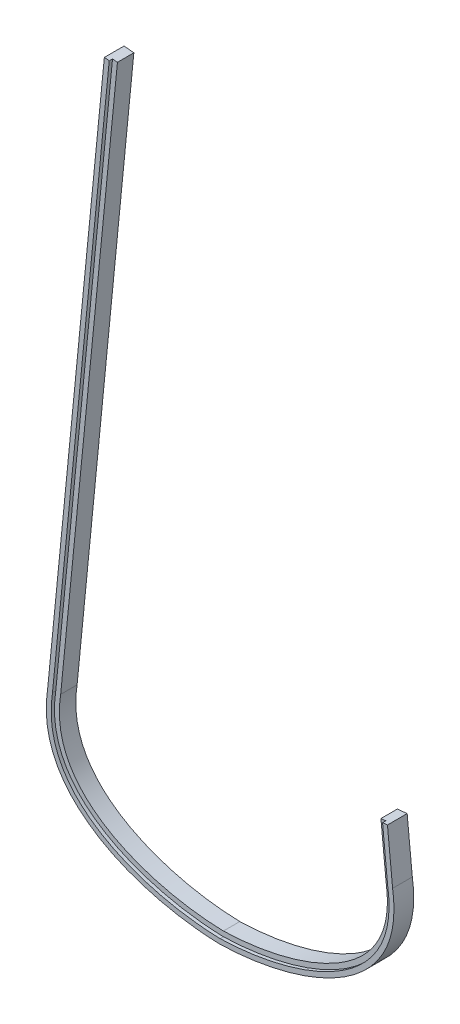
ISO-10303-21;
HEADER;
FILE_DESCRIPTION(('STEP AP214'),'2;1');
FILE_NAME('part.step','',(''),(''),'','','');
FILE_SCHEMA(('AUTOMOTIVE_DESIGN { 1 0 10303 214 1 1 1 1 }'));
ENDSEC;
DATA;
#1=APPLICATION_CONTEXT('core data for automotive mechanical design processes');
#2=APPLICATION_PROTOCOL_DEFINITION('international standard','automotive_design',2000,#1);
#3=PRODUCT_CONTEXT('',#1,'mechanical');
#4=PRODUCT('Part','Part','',(#3));
#5=PRODUCT_RELATED_PRODUCT_CATEGORY('part','',(#4));
#6=PRODUCT_DEFINITION_FORMATION('','',#4);
#7=PRODUCT_DEFINITION_CONTEXT('part definition',#1,'design');
#8=PRODUCT_DEFINITION('design','',#6,#7);
#9=PRODUCT_DEFINITION_SHAPE('','',#8);
#10=(LENGTH_UNIT() NAMED_UNIT(*) SI_UNIT(.MILLI.,.METRE.));
#11=(NAMED_UNIT(*) PLANE_ANGLE_UNIT() SI_UNIT($,.RADIAN.));
#12=(NAMED_UNIT(*) SI_UNIT($,.STERADIAN.) SOLID_ANGLE_UNIT());
#13=UNCERTAINTY_MEASURE_WITH_UNIT(LENGTH_MEASURE(1.E-05),#10,'distance_accuracy_value','');
#14=(GEOMETRIC_REPRESENTATION_CONTEXT(3) GLOBAL_UNCERTAINTY_ASSIGNED_CONTEXT((#13)) GLOBAL_UNIT_ASSIGNED_CONTEXT((#10,
#11,#12)) REPRESENTATION_CONTEXT('',''));
#15=CARTESIAN_POINT('',(0.,0.,0.));
#16=DIRECTION('',(0.,0.,1.));
#17=DIRECTION('',(1.,0.,0.));
#18=AXIS2_PLACEMENT_3D('',#15,#16,#17);
#19=CARTESIAN_POINT('',(152.2241731931,179.795336583671,19.05));
#20=DIRECTION('',(0.0981158450861748,-0.995175000159784,0.));
#21=DIRECTION('',(0.995175000159784,0.0981158450861748,0.));
#22=AXIS2_PLACEMENT_3D('',#19,#20,#21);
#23=PLANE('',#22);
#24=DIRECTION('',(0.,0.,-1.));
#25=VECTOR('',#24,1.);
#26=CARTESIAN_POINT('',(156.976332853863,180.263859367127,1004.92320168636));
#27=LINE('',#26,#25);
#28=CARTESIAN_POINT('',(156.976332853863,180.263859367127,19.05));
#29=VERTEX_POINT('',#28);
#30=CARTESIAN_POINT('',(156.976332853863,180.263859367127,15.875));
#31=VERTEX_POINT('',#30);
#32=EDGE_CURVE('E154',#29,#31,#27,.T.);
#33=ORIENTED_EDGE('',*,*,#32,.F.);
#34=DIRECTION('',(-0.995175000159784,-0.0981158450861748,0.));
#35=VECTOR('',#34,1.);
#36=CARTESIAN_POINT('',(152.2241731931,179.795336583671,19.05));
#37=LINE('',#36,#35);
#38=CARTESIAN_POINT('',(161.703215069622,180.729890008117,19.05));
#39=VERTEX_POINT('',#38);
#40=EDGE_CURVE('E142',#39,#29,#37,.T.);
#41=ORIENTED_EDGE('',*,*,#40,.F.);
#42=DIRECTION('',(0.,0.,-1.));
#43=VECTOR('',#42,1.);
#44=CARTESIAN_POINT('',(161.703215069622,180.729890008117,19.05));
#45=LINE('',#44,#43);
#46=CARTESIAN_POINT('',(161.703215069622,180.729890008117,0.));
#47=VERTEX_POINT('',#46);
#48=EDGE_CURVE('E42',#39,#47,#45,.T.);
#49=ORIENTED_EDGE('',*,*,#48,.T.);
#50=DIRECTION('',(-0.995175000159784,-0.0981158450861748,0.));
#51=VECTOR('',#50,1.);
#52=CARTESIAN_POINT('',(152.2241731931,179.795336583671,0.));
#53=LINE('',#52,#51);
#54=CARTESIAN_POINT('',(152.2241731931,179.795336583671,0.));
#55=VERTEX_POINT('',#54);
#56=EDGE_CURVE('E242',#47,#55,#53,.T.);
#57=ORIENTED_EDGE('',*,*,#56,.T.);
#58=DIRECTION('',(0.,0.,-1.));
#59=VECTOR('',#58,1.);
#60=CARTESIAN_POINT('',(152.2241731931,179.795336583671,19.05));
#61=LINE('',#60,#59);
#62=CARTESIAN_POINT('',(152.2241731931,179.795336583671,15.875));
#63=VERTEX_POINT('',#62);
#64=EDGE_CURVE('E295',#63,#55,#61,.T.);
#65=ORIENTED_EDGE('',*,*,#64,.F.);
#66=DIRECTION('',(-0.995175000159784,-0.0981158450861748,0.));
#67=VECTOR('',#66,1.);
#68=CARTESIAN_POINT('',(152.2241731931,179.795336583671,15.875));
#69=LINE('',#68,#67);
#70=EDGE_CURVE('E49',#31,#63,#69,.T.);
#71=ORIENTED_EDGE('',*,*,#70,.F.);
#72=EDGE_LOOP('',(#33,#41,#49,#57,#65,#71));
#73=FACE_BOUND('',#72,.T.);
#74=ADVANCED_FACE('F33',(#73),#23,.F.);
#75=CARTESIAN_POINT('',(-111.860365765845,686.278790089287,19.05));
#76=DIRECTION('',(-0.0981158450861748,-0.995175000159784,0.));
#77=DIRECTION('',(0.995175000159784,-0.0981158450861748,0.));
#78=AXIS2_PLACEMENT_3D('',#75,#76,#77);
#79=PLANE('',#78);
#80=DIRECTION('',(0.,0.,-1.));
#81=VECTOR('',#80,1.);
#82=CARTESIAN_POINT('',(-107.133483550086,685.812759448297,1004.92320168636));
#83=LINE('',#82,#81);
#84=CARTESIAN_POINT('',(-107.133483550086,685.812759448297,19.05));
#85=VERTEX_POINT('',#84);
#86=CARTESIAN_POINT('',(-107.133483550088,685.812759448297,15.875));
#87=VERTEX_POINT('',#86);
#88=EDGE_CURVE('E174',#85,#87,#83,.T.);
#89=ORIENTED_EDGE('',*,*,#88,.T.);
#90=DIRECTION('',(-0.995175000159784,0.0981158450861748,0.));
#91=VECTOR('',#90,1.);
#92=CARTESIAN_POINT('',(-111.860365765845,686.278790089287,15.875));
#93=LINE('',#92,#91);
#94=CARTESIAN_POINT('',(-102.381323889323,685.344236664841,15.875));
#95=VERTEX_POINT('',#94);
#96=EDGE_CURVE('E328',#95,#87,#93,.T.);
#97=ORIENTED_EDGE('',*,*,#96,.F.);
#98=DIRECTION('',(0.,0.,-1.));
#99=VECTOR('',#98,1.);
#100=CARTESIAN_POINT('',(-102.381323889323,685.344236664841,19.05));
#101=LINE('',#100,#99);
#102=CARTESIAN_POINT('',(-102.381323889323,685.344236664841,0.));
#103=VERTEX_POINT('',#102);
#104=EDGE_CURVE('E287',#95,#103,#101,.T.);
#105=ORIENTED_EDGE('',*,*,#104,.T.);
#106=DIRECTION('',(-0.995175000159784,0.0981158450861748,0.));
#107=VECTOR('',#106,1.);
#108=CARTESIAN_POINT('',(-111.860365765845,686.278790089287,0.));
#109=LINE('',#108,#107);
#110=CARTESIAN_POINT('',(-111.860365765845,686.278790089287,0.));
#111=VERTEX_POINT('',#110);
#112=EDGE_CURVE('E267',#103,#111,#109,.T.);
#113=ORIENTED_EDGE('',*,*,#112,.T.);
#114=DIRECTION('',(0.,0.,-1.));
#115=VECTOR('',#114,1.);
#116=CARTESIAN_POINT('',(-111.860365765845,686.278790089287,19.05));
#117=LINE('',#116,#115);
#118=CARTESIAN_POINT('',(-111.860365765845,686.278790089287,19.05));
#119=VERTEX_POINT('',#118);
#120=EDGE_CURVE('E284',#119,#111,#117,.T.);
#121=ORIENTED_EDGE('',*,*,#120,.F.);
#122=DIRECTION('',(-0.995175000159784,0.0981158450861748,0.));
#123=VECTOR('',#122,1.);
#124=CARTESIAN_POINT('',(-111.860365765845,686.278790089287,19.05));
#125=LINE('',#124,#123);
#126=EDGE_CURVE('E151',#85,#119,#125,.T.);
#127=ORIENTED_EDGE('',*,*,#126,.F.);
#128=EDGE_LOOP('',(#89,#97,#105,#113,#121,#127));
#129=FACE_BOUND('',#128,.T.);
#130=ADVANCED_FACE('F210',(#129),#79,.F.);
#131=CARTESIAN_POINT('',(116.406439868411,30.4999418503284,19.05));
#132=DIRECTION('',(0.,0.,-1.));
#133=DIRECTION('',(-1.,0.,0.));
#134=AXIS2_PLACEMENT_3D('',#131,#132,#133);
#135=PLANE('',#134);
#136=DIRECTION('',(0.0981158450861758,0.995175000159784,0.));
#137=VECTOR('',#136,1.);
#138=CARTESIAN_POINT('',(-107.133483550086,685.812759448297,19.05));
#139=LINE('',#138,#137);
#140=CARTESIAN_POINT('',(-161.973395498476,129.579366828916,19.05));
#141=VERTEX_POINT('',#140);
#142=EDGE_CURVE('E330',#141,#85,#139,.T.);
#143=ORIENTED_EDGE('',*,*,#142,.T.);
#144=ORIENTED_EDGE('',*,*,#126,.T.);
#145=DIRECTION('',(-0.0981158450861758,-0.995175000159784,0.));
#146=VECTOR('',#145,1.);
#147=CARTESIAN_POINT('',(-166.6875,130.175,19.05));
#148=LINE('',#147,#146);
#149=CARTESIAN_POINT('',(-166.6875,130.175,19.05));
#150=VERTEX_POINT('',#149);
#151=EDGE_CURVE('E228',#119,#150,#148,.T.);
#152=ORIENTED_EDGE('',*,*,#151,.T.);
#153=CARTESIAN_POINT('',(-166.6875,130.175,19.05));
#154=CARTESIAN_POINT('',(-181.188092360691,36.2008356091117,19.05));
#155=CARTESIAN_POINT('',(-73.6665806217367,1.74067599176395,19.05));
#156=CARTESIAN_POINT('',(0.,0.,19.05));
#157=B_SPLINE_CURVE_WITH_KNOTS('',3,(#153,#154,#155,#156),.UNSPECIFIED.,.F.,.F.,(4,4),(0.,1.),.UNSPECIFIED.);
#158=CARTESIAN_POINT('',(0.,0.,19.05));
#159=VERTEX_POINT('',#158);
#160=EDGE_CURVE('E221',#150,#159,#157,.T.);
#161=ORIENTED_EDGE('',*,*,#160,.T.);
#162=CARTESIAN_POINT('',(0.,0.,19.05));
#163=CARTESIAN_POINT('',(73.6665806217367,1.74067599176395,19.05));
#164=CARTESIAN_POINT('',(181.188092360691,36.2008356091117,19.05));
#165=CARTESIAN_POINT('',(166.6875,130.175,19.05));
#166=B_SPLINE_CURVE_WITH_KNOTS('',3,(#162,#163,#164,#165),.UNSPECIFIED.,.F.,.F.,(4,4),(0.,1.),.UNSPECIFIED.);
#167=CARTESIAN_POINT('',(166.6875,130.175,19.05));
#168=VERTEX_POINT('',#167);
#169=EDGE_CURVE('E275',#159,#168,#166,.T.);
#170=ORIENTED_EDGE('',*,*,#169,.T.);
#171=DIRECTION('',(-0.0981158450861751,0.995175000159784,0.));
#172=VECTOR('',#171,1.);
#173=CARTESIAN_POINT('',(166.6875,130.175,19.05));
#174=LINE('',#173,#172);
#175=EDGE_CURVE('E148',#168,#39,#174,.T.);
#176=ORIENTED_EDGE('',*,*,#175,.T.);
#177=ORIENTED_EDGE('',*,*,#40,.T.);
#178=DIRECTION('',(0.0981158450861751,-0.995175000159784,0.));
#179=VECTOR('',#178,1.);
#180=CARTESIAN_POINT('',(161.973395498476,129.579366828916,19.05));
#181=LINE('',#180,#179);
#182=CARTESIAN_POINT('',(161.973395498476,129.579366828916,19.05));
#183=VERTEX_POINT('',#182);
#184=EDGE_CURVE('E145',#29,#183,#181,.T.);
#185=ORIENTED_EDGE('',*,*,#184,.T.);
#186=CARTESIAN_POINT('',(0.,4.75115094781175,19.05));
#187=CARTESIAN_POINT('',(9.04086704814806,4.96882985998488,19.05));
#188=CARTESIAN_POINT('',(18.6188377679575,5.68935997812849,19.05));
#189=CARTESIAN_POINT('',(38.2135660454949,8.24005886868246,19.05));
#190=CARTESIAN_POINT('',(48.2306301838691,10.0702165133301,19.05));
#191=CARTESIAN_POINT('',(68.0758906685515,14.9340860270054,19.05));
#192=CARTESIAN_POINT('',(77.9040582812842,17.9680134662575,19.05));
#193=CARTESIAN_POINT('',(96.7462292371681,25.3204715644106,19.05));
#194=CARTESIAN_POINT('',(105.759630554442,29.6392292408285,19.05));
#195=CARTESIAN_POINT('',(122.357367523378,39.621644840968,19.05));
#196=CARTESIAN_POINT('',(129.940113205013,45.2843535157301,19.05));
#197=CARTESIAN_POINT('',(139.81311424625,54.8199574214553,19.05));
#198=CARTESIAN_POINT('',(142.854480947945,58.1720089135256,19.05));
#199=CARTESIAN_POINT('',(148.374445898117,65.2328355384419,19.05));
#200=CARTESIAN_POINT('',(150.853165212881,68.9414654515358,19.05));
#201=CARTESIAN_POINT('',(155.188366145905,76.7330216576851,19.05));
#202=CARTESIAN_POINT('',(157.045094148206,80.8159513897656,19.05));
#203=CARTESIAN_POINT('',(160.075199692569,89.384607046216,19.05));
#204=CARTESIAN_POINT('',(161.248767489306,93.8705723700118,19.05));
#205=CARTESIAN_POINT('',(162.842404670833,103.281195989753,19.05));
#206=CARTESIAN_POINT('',(163.262423556054,108.206156668145,19.05));
#207=CARTESIAN_POINT('',(163.265984358027,115.948323614976,19.05));
#208=CARTESIAN_POINT('',(163.16267737973,118.588121623498,19.05));
#209=CARTESIAN_POINT('',(162.842770083122,122.639027203061,19.05));
#210=CARTESIAN_POINT('',(162.708640489147,124.004525813686,19.05));
#211=CARTESIAN_POINT('',(162.46516212669,126.075850352861,19.05));
#212=CARTESIAN_POINT('',(162.332851825039,127.117281326474,19.05));
#213=CARTESIAN_POINT('',(162.159761135535,128.342436218243,19.05));
#214=CARTESIAN_POINT('',(162.081541527909,128.86968384369,19.05));
#215=CARTESIAN_POINT('',(162.028495082377,129.221667617639,19.05));
#216=CARTESIAN_POINT('',(162.001715249747,129.395834674141,19.05));
#217=CARTESIAN_POINT('',(161.973395498476,129.579366828916,19.05));
#218=B_SPLINE_CURVE_WITH_KNOTS('',3,(#186,#187,#188,#189,#190,#191,#192,#193,#194,#195,#196,
#197,#198,#199,#200,#201,#202,#203,#204,#205,#206,#207,#208,#209,#210,#211,#212,#213,#214,#215,
#216,#217),.UNSPECIFIED.,.F.,.F.,(4,2,2,2,2,2,2,2,2,2,2,2,2,1,1,2,4),(0.,0.125,0.25,0.375,0.5,
0.625,0.6875,0.75,0.8125,0.875,0.9375,0.96875,0.984375,0.9921875,0.99609375,0.998046875,1.),.UNSPECIFIED.);
#219=CARTESIAN_POINT('',(0.,4.75115094781175,19.05));
#220=VERTEX_POINT('',#219);
#221=EDGE_CURVE('E164',#183,#220,#218,.F.);
#222=ORIENTED_EDGE('',*,*,#221,.T.);
#223=CARTESIAN_POINT('',(-161.973395498476,129.579366828916,19.05));
#224=CARTESIAN_POINT('',(-162.001715249747,129.39583467414,19.05));
#225=CARTESIAN_POINT('',(-162.028495082377,129.221667617639,19.05));
#226=CARTESIAN_POINT('',(-162.081541527909,128.869683843689,19.05));
#227=CARTESIAN_POINT('',(-162.159761135535,128.342436218243,19.05));
#228=CARTESIAN_POINT('',(-162.332851825039,127.117281326474,19.05));
#229=CARTESIAN_POINT('',(-162.641575692159,124.687275118998,19.05));
#230=CARTESIAN_POINT('',(-162.842770083122,122.639027203061,19.05));
#231=CARTESIAN_POINT('',(-163.16267737973,118.588121623498,19.05));
#232=CARTESIAN_POINT('',(-163.265984358027,115.948323614976,19.05));
#233=CARTESIAN_POINT('',(-163.262423556053,108.206156668145,19.05));
#234=CARTESIAN_POINT('',(-162.842404670833,103.281195989753,19.05));
#235=CARTESIAN_POINT('',(-161.248767489306,93.8705723700115,19.05));
#236=CARTESIAN_POINT('',(-160.075199692569,89.3846070462159,19.05));
#237=CARTESIAN_POINT('',(-157.045094148206,80.8159513897654,19.05));
#238=CARTESIAN_POINT('',(-155.188366145905,76.7330216576849,19.05));
#239=CARTESIAN_POINT('',(-150.853165212881,68.9414654515357,19.05));
#240=CARTESIAN_POINT('',(-148.374445898117,65.2328355384417,19.05));
#241=CARTESIAN_POINT('',(-142.854480947945,58.1720089135254,19.05));
#242=CARTESIAN_POINT('',(-139.81311424625,54.8199574214552,19.05));
#243=CARTESIAN_POINT('',(-129.940113205013,45.28435351573,19.05));
#244=CARTESIAN_POINT('',(-122.357367523378,39.621644840968,19.05));
#245=CARTESIAN_POINT('',(-105.759630554442,29.6392292408284,19.05));
#246=CARTESIAN_POINT('',(-96.7462292371681,25.3204715644106,19.05));
#247=CARTESIAN_POINT('',(-77.9040582812842,17.9680134662575,19.05));
#248=CARTESIAN_POINT('',(-68.0758906685514,14.9340860270054,19.05));
#249=CARTESIAN_POINT('',(-48.2306301838691,10.0702165133301,19.05));
#250=CARTESIAN_POINT('',(-38.2135660454949,8.24005886868246,19.05));
#251=CARTESIAN_POINT('',(-18.6188377679576,5.68935997812849,19.05));
#252=CARTESIAN_POINT('',(-9.04086704814806,4.96882985998489,19.05));
#253=CARTESIAN_POINT('',(0.,4.75115094781175,19.05));
#254=B_SPLINE_CURVE_WITH_KNOTS('',3,(#223,#224,#225,#226,#227,#228,#229,#230,#231,#232,#233,
#234,#235,#236,#237,#238,#239,#240,#241,#242,#243,#244,#245,#246,#247,#248,#249,#250,#251,#252,
#253),.UNSPECIFIED.,.F.,.F.,(4,2,1,1,1,2,2,2,2,2,2,2,2,2,2,2,4),(0.,0.00195312499999983,
0.00390624999999966,0.00781249999999967,0.0156249999999997,0.0312499999999997,
0.0624999999999996,0.124999999999999,0.187499999999999,0.249999999999999,0.312499999999999,
0.374999999999999,0.499999999999999,0.624999999999999,0.75,0.875,1.),.UNSPECIFIED.);
#255=EDGE_CURVE('E168',#220,#141,#254,.F.);
#256=ORIENTED_EDGE('',*,*,#255,.T.);
#257=EDGE_LOOP('',(#143,#144,#152,#161,#170,#176,#177,#185,#222,#256));
#258=FACE_BOUND('',#257,.T.);
#259=ADVANCED_FACE('F143',(#258),#135,.F.);
#260=DIRECTION('',(0.,0.,-1.));
#261=VECTOR('',#260,1.);
#262=SURFACE_OF_LINEAR_EXTRUSION('',#166,#261);
#263=CARTESIAN_POINT('',(0.,0.,0.));
#264=CARTESIAN_POINT('',(73.6665806217367,1.74067599176395,0.));
#265=CARTESIAN_POINT('',(181.188092360691,36.2008356091117,0.));
#266=CARTESIAN_POINT('',(166.6875,130.175,0.));
#267=B_SPLINE_CURVE_WITH_KNOTS('',3,(#263,#264,#265,#266),.UNSPECIFIED.,.F.,.F.,(4,4),(0.,1.),.UNSPECIFIED.);
#268=CARTESIAN_POINT('',(0.,0.,0.));
#269=VERTEX_POINT('',#268);
#270=CARTESIAN_POINT('',(166.6875,130.175,0.));
#271=VERTEX_POINT('',#270);
#272=EDGE_CURVE('E176',#269,#271,#267,.T.);
#273=ORIENTED_EDGE('',*,*,#272,.T.);
#274=DIRECTION('',(0.,0.,-1.));
#275=VECTOR('',#274,1.);
#276=CARTESIAN_POINT('',(166.6875,130.175,19.05));
#277=LINE('',#276,#275);
#278=EDGE_CURVE('E11',#168,#271,#277,.T.);
#279=ORIENTED_EDGE('',*,*,#278,.F.);
#280=ORIENTED_EDGE('',*,*,#169,.F.);
#281=DIRECTION('',(0.,0.,-1.));
#282=VECTOR('',#281,1.);
#283=CARTESIAN_POINT('',(0.,0.,19.05));
#284=LINE('',#283,#282);
#285=EDGE_CURVE('E227',#159,#269,#284,.T.);
#286=ORIENTED_EDGE('',*,*,#285,.T.);
#287=EDGE_LOOP('',(#273,#279,#280,#286));
#288=FACE_BOUND('',#287,.T.);
#289=ADVANCED_FACE('F35',(#288),#262,.F.);
#290=CARTESIAN_POINT('',(166.6875,130.175,19.05));
#291=DIRECTION('',(-0.995175000159784,-0.0981158450861751,0.));
#292=DIRECTION('',(0.0981158450861752,-0.995175000159784,0.));
#293=AXIS2_PLACEMENT_3D('',#290,#291,#292);
#294=PLANE('',#293);
#295=DIRECTION('',(-0.0981158450861751,0.995175000159784,0.));
#296=VECTOR('',#295,1.);
#297=CARTESIAN_POINT('',(166.6875,130.175,0.));
#298=LINE('',#297,#296);
#299=EDGE_CURVE('E237',#271,#47,#298,.T.);
#300=ORIENTED_EDGE('',*,*,#299,.T.);
#301=ORIENTED_EDGE('',*,*,#48,.F.);
#302=ORIENTED_EDGE('',*,*,#175,.F.);
#303=ORIENTED_EDGE('',*,*,#278,.T.);
#304=EDGE_LOOP('',(#300,#301,#302,#303));
#305=FACE_BOUND('',#304,.T.);
#306=ADVANCED_FACE('F359',(#305),#294,.F.);
#307=CARTESIAN_POINT('',(157.23408188197,128.980548453709,19.05));
#308=DIRECTION('',(0.995175000159784,0.0981158450861752,0.));
#309=DIRECTION('',(-0.0981158450861752,0.995175000159784,0.));
#310=AXIS2_PLACEMENT_3D('',#307,#308,#309);
#311=PLANE('',#310);
#312=DIRECTION('',(0.,0.,-1.));
#313=VECTOR('',#312,1.);
#314=CARTESIAN_POINT('',(157.23408188197,128.980548453709,19.05));
#315=LINE('',#314,#313);
#316=CARTESIAN_POINT('',(157.23408188197,128.980548453709,15.875));
#317=VERTEX_POINT('',#316);
#318=CARTESIAN_POINT('',(157.23408188197,128.980548453709,0.));
#319=VERTEX_POINT('',#318);
#320=EDGE_CURVE('E293',#317,#319,#315,.T.);
#321=ORIENTED_EDGE('',*,*,#320,.F.);
#322=DIRECTION('',(0.0981158450861752,-0.995175000159784,0.));
#323=VECTOR('',#322,1.);
#324=CARTESIAN_POINT('',(157.23408188197,128.980548453709,15.875));
#325=LINE('',#324,#323);
#326=EDGE_CURVE('E57',#63,#317,#325,.T.);
#327=ORIENTED_EDGE('',*,*,#326,.F.);
#328=ORIENTED_EDGE('',*,*,#64,.T.);
#329=DIRECTION('',(0.0981158450861752,-0.995175000159784,0.));
#330=VECTOR('',#329,1.);
#331=CARTESIAN_POINT('',(157.23408188197,128.980548453709,0.));
#332=LINE('',#331,#330);
#333=EDGE_CURVE('E245',#55,#319,#332,.T.);
#334=ORIENTED_EDGE('',*,*,#333,.T.);
#335=EDGE_LOOP('',(#321,#327,#328,#334));
#336=FACE_BOUND('',#335,.T.);
#337=ADVANCED_FACE('F302',(#336),#311,.F.);
#338=CARTESIAN_POINT('',(157.23408188197,128.980548453709,19.05));
#339=CARTESIAN_POINT('',(157.261207353425,128.80475608259,19.05));
#340=CARTESIAN_POINT('',(157.316566229368,128.44670539477,19.05));
#341=CARTESIAN_POINT('',(157.415798732615,127.781927865814,19.05));
#342=CARTESIAN_POINT('',(157.584058118054,126.601085874369,19.05));
#343=CARTESIAN_POINT('',(157.881730698016,124.277278240634,19.05));
#344=CARTESIAN_POINT('',(158.206421640057,121.010360534751,19.05));
#345=CARTESIAN_POINT('',(158.437150465931,117.190167218602,19.05));
#346=CARTESIAN_POINT('',(158.540175043748,112.221426054033,19.05));
#347=CARTESIAN_POINT('',(158.296409220294,106.242287004757,19.05));
#348=CARTESIAN_POINT('',(157.442658539271,99.4182067892226,19.05));
#349=CARTESIAN_POINT('',(156.058613173129,92.923629982478,19.05));
#350=CARTESIAN_POINT('',(153.541361304269,84.6740226733845,19.05));
#351=CARTESIAN_POINT('',(149.192253507085,75.0755375544253,19.05));
#352=CARTESIAN_POINT('',(142.189146148936,64.5645369341676,19.05));
#353=CARTESIAN_POINT('',(130.643933927823,51.8035577227428,19.05));
#354=CARTESIAN_POINT('',(112.436111513656,38.1574524872599,19.05));
#355=CARTESIAN_POINT('',(90.5158541949529,27.6265370641219,19.05));
#356=CARTESIAN_POINT('',(71.6896130592172,21.0508508509878,19.05));
#357=CARTESIAN_POINT('',(57.16523288768,17.0231489798574,19.05));
#358=CARTESIAN_POINT('',(42.4774975697848,13.8758580326201,19.05));
#359=CARTESIAN_POINT('',(30.3032357230849,11.9623162671414,19.05));
#360=CARTESIAN_POINT('',(20.7254590356733,10.8404413717739,19.05));
#361=CARTESIAN_POINT('',(13.6522104162235,10.1989584372761,19.05));
#362=CARTESIAN_POINT('',(7.88003948147285,9.82720773209708,19.05));
#363=CARTESIAN_POINT('',(3.34047289736703,9.62475505591648,19.05));
#364=CARTESIAN_POINT('',(1.11761160220118,9.55519319222505,19.05));
#365=CARTESIAN_POINT('',(0.,9.52776173986118,19.05));
#366=B_SPLINE_CURVE_WITH_KNOTS('',3,(#338,#339,#340,#341,#342,#343,#344,#345,#346,#347,#348,
#349,#350,#351,#352,#353,#354,#355,#356,#357,#358,#359,#360,#361,#362,#363,#364,#365),
.UNSPECIFIED.,.F.,.F.,(4,1,1,1,1,1,1,1,1,1,1,1,1,1,1,1,1,1,1,1,1,1,1,1,1,4),
(0.00105703595463424,0.00300988454184536,0.00496273312905637,0.0088684303034785,
0.0166798246523227,0.0323026133500111,0.0479254020476996,0.063548190745388,0.0947937681407649,
0.126039345536142,0.157284922931519,0.188530500326895,0.251021655117649,0.313512809908403,
0.376003964699156,0.500986274280664,0.625968583862171,0.688459738652925,0.750950893443679,
0.813442048234432,0.875933203025186,0.907178780420563,0.93842435781594,0.969669935211317,
0.985292723909005,1.00091551260669),.UNSPECIFIED.);
#367=DIRECTION('',(0.,0.,-1.));
#368=VECTOR('',#367,1.);
#369=SURFACE_OF_LINEAR_EXTRUSION('',#366,#368);
#370=DIRECTION('',(0.,0.,-1.));
#371=VECTOR('',#370,1.);
#372=CARTESIAN_POINT('',(0.,9.52776173986118,19.05));
#373=LINE('',#372,#371);
#374=CARTESIAN_POINT('',(0.,9.52776173986118,15.875));
#375=VERTEX_POINT('',#374);
#376=CARTESIAN_POINT('',(0.,9.52776173986118,0.));
#377=VERTEX_POINT('',#376);
#378=EDGE_CURVE('E291',#375,#377,#373,.T.);
#379=ORIENTED_EDGE('',*,*,#378,.F.);
#380=CARTESIAN_POINT('',(157.23408188197,128.980548453709,15.875));
#381=CARTESIAN_POINT('',(157.261207353425,128.80475608259,15.875));
#382=CARTESIAN_POINT('',(157.316566229368,128.44670539477,15.875));
#383=CARTESIAN_POINT('',(157.415798732615,127.781927865814,15.875));
#384=CARTESIAN_POINT('',(157.584058118054,126.601085874369,15.875));
#385=CARTESIAN_POINT('',(157.881730698016,124.277278240634,15.875));
#386=CARTESIAN_POINT('',(158.206421640057,121.010360534751,15.875));
#387=CARTESIAN_POINT('',(158.437150465931,117.190167218602,15.875));
#388=CARTESIAN_POINT('',(158.540175043748,112.221426054033,15.875));
#389=CARTESIAN_POINT('',(158.296409220294,106.242287004757,15.875));
#390=CARTESIAN_POINT('',(157.442658539271,99.4182067892226,15.875));
#391=CARTESIAN_POINT('',(156.058613173129,92.923629982478,15.875));
#392=CARTESIAN_POINT('',(153.541361304269,84.6740226733845,15.875));
#393=CARTESIAN_POINT('',(149.192253507085,75.0755375544253,15.875));
#394=CARTESIAN_POINT('',(142.189146148936,64.5645369341676,15.875));
#395=CARTESIAN_POINT('',(130.643933927823,51.8035577227428,15.875));
#396=CARTESIAN_POINT('',(112.436111513656,38.1574524872599,15.875));
#397=CARTESIAN_POINT('',(90.5158541949529,27.6265370641219,15.875));
#398=CARTESIAN_POINT('',(71.6896130592172,21.0508508509878,15.875));
#399=CARTESIAN_POINT('',(57.16523288768,17.0231489798574,15.875));
#400=CARTESIAN_POINT('',(42.4774975697848,13.8758580326201,15.875));
#401=CARTESIAN_POINT('',(30.3032357230849,11.9623162671414,15.875));
#402=CARTESIAN_POINT('',(20.7254590356733,10.8404413717739,15.875));
#403=CARTESIAN_POINT('',(13.6522104162235,10.1989584372761,15.875));
#404=CARTESIAN_POINT('',(7.88003948147285,9.82720773209708,15.875));
#405=CARTESIAN_POINT('',(3.34047289736703,9.62475505591648,15.875));
#406=CARTESIAN_POINT('',(1.11761160220118,9.55519319222505,15.875));
#407=CARTESIAN_POINT('',(0.,9.52776173986118,15.875));
#408=B_SPLINE_CURVE_WITH_KNOTS('',3,(#380,#381,#382,#383,#384,#385,#386,#387,#388,#389,#390,
#391,#392,#393,#394,#395,#396,#397,#398,#399,#400,#401,#402,#403,#404,#405,#406,#407),
.UNSPECIFIED.,.F.,.F.,(4,1,1,1,1,1,1,1,1,1,1,1,1,1,1,1,1,1,1,1,1,1,1,1,1,4),
(0.00105703595463424,0.00300988454184536,0.00496273312905637,0.0088684303034785,
0.0166798246523227,0.0323026133500111,0.0479254020476996,0.063548190745388,0.0947937681407649,
0.126039345536142,0.157284922931519,0.188530500326895,0.251021655117649,0.313512809908403,
0.376003964699156,0.500986274280664,0.625968583862171,0.688459738652925,0.750950893443679,
0.813442048234432,0.875933203025186,0.907178780420563,0.93842435781594,0.969669935211317,
0.985292723909005,1.00091551260669),.UNSPECIFIED.);
#409=EDGE_CURVE('E305',#317,#375,#408,.T.);
#410=ORIENTED_EDGE('',*,*,#409,.F.);
#411=ORIENTED_EDGE('',*,*,#320,.T.);
#412=CARTESIAN_POINT('',(157.23408188197,128.980548453709,0.));
#413=CARTESIAN_POINT('',(157.261207353425,128.80475608259,0.));
#414=CARTESIAN_POINT('',(157.316566229368,128.44670539477,0.));
#415=CARTESIAN_POINT('',(157.415798732615,127.781927865814,0.));
#416=CARTESIAN_POINT('',(157.584058118054,126.601085874369,0.));
#417=CARTESIAN_POINT('',(157.881730698016,124.277278240634,0.));
#418=CARTESIAN_POINT('',(158.206421640057,121.010360534751,0.));
#419=CARTESIAN_POINT('',(158.437150465931,117.190167218602,0.));
#420=CARTESIAN_POINT('',(158.540175043748,112.221426054033,0.));
#421=CARTESIAN_POINT('',(158.296409220294,106.242287004757,0.));
#422=CARTESIAN_POINT('',(157.442658539271,99.4182067892226,0.));
#423=CARTESIAN_POINT('',(156.058613173129,92.923629982478,0.));
#424=CARTESIAN_POINT('',(153.541361304269,84.6740226733845,0.));
#425=CARTESIAN_POINT('',(149.192253507085,75.0755375544253,0.));
#426=CARTESIAN_POINT('',(142.189146148936,64.5645369341676,0.));
#427=CARTESIAN_POINT('',(130.643933927823,51.8035577227428,0.));
#428=CARTESIAN_POINT('',(112.436111513656,38.1574524872599,0.));
#429=CARTESIAN_POINT('',(90.5158541949529,27.6265370641219,0.));
#430=CARTESIAN_POINT('',(71.6896130592172,21.0508508509878,0.));
#431=CARTESIAN_POINT('',(57.16523288768,17.0231489798574,0.));
#432=CARTESIAN_POINT('',(42.4774975697848,13.8758580326201,0.));
#433=CARTESIAN_POINT('',(30.3032357230849,11.9623162671414,0.));
#434=CARTESIAN_POINT('',(20.7254590356733,10.8404413717739,0.));
#435=CARTESIAN_POINT('',(13.6522104162235,10.1989584372761,0.));
#436=CARTESIAN_POINT('',(7.88003948147285,9.82720773209708,0.));
#437=CARTESIAN_POINT('',(3.34047289736703,9.62475505591648,0.));
#438=CARTESIAN_POINT('',(1.11761160220118,9.55519319222505,0.));
#439=CARTESIAN_POINT('',(0.,9.52776173986118,0.));
#440=B_SPLINE_CURVE_WITH_KNOTS('',3,(#412,#413,#414,#415,#416,#417,#418,#419,#420,#421,#422,
#423,#424,#425,#426,#427,#428,#429,#430,#431,#432,#433,#434,#435,#436,#437,#438,#439),
.UNSPECIFIED.,.F.,.F.,(4,1,1,1,1,1,1,1,1,1,1,1,1,1,1,1,1,1,1,1,1,1,1,1,1,4),
(0.00105703595463424,0.00300988454184536,0.00496273312905637,0.0088684303034785,
0.0166798246523227,0.0323026133500111,0.0479254020476996,0.063548190745388,0.0947937681407649,
0.126039345536142,0.157284922931519,0.188530500326895,0.251021655117649,0.313512809908403,
0.376003964699156,0.500986274280664,0.625968583862171,0.688459738652925,0.750950893443679,
0.813442048234432,0.875933203025186,0.907178780420563,0.93842435781594,0.969669935211317,
0.985292723909005,1.00091551260669),.UNSPECIFIED.);
#441=EDGE_CURVE('E248',#319,#377,#440,.T.);
#442=ORIENTED_EDGE('',*,*,#441,.T.);
#443=EDGE_LOOP('',(#379,#410,#411,#442));
#444=FACE_BOUND('',#443,.T.);
#445=ADVANCED_FACE('F350',(#444),#369,.F.);
#446=CARTESIAN_POINT('',(0.,9.52776173986118,19.05));
#447=CARTESIAN_POINT('',(-1.11761160220116,9.55519319222505,19.05));
#448=CARTESIAN_POINT('',(-3.34047289736702,9.62475505591649,19.05));
#449=CARTESIAN_POINT('',(-7.88003948147278,9.82720773209708,19.05));
#450=CARTESIAN_POINT('',(-13.6522104162235,10.1989584372761,19.05));
#451=CARTESIAN_POINT('',(-20.7254590356733,10.8404413717739,19.05));
#452=CARTESIAN_POINT('',(-30.303235723085,11.9623162671414,19.05));
#453=CARTESIAN_POINT('',(-42.4774975697847,13.8758580326201,19.05));
#454=CARTESIAN_POINT('',(-57.16523288768,17.0231489798574,19.05));
#455=CARTESIAN_POINT('',(-71.6896130592172,21.0508508509878,19.05));
#456=CARTESIAN_POINT('',(-90.5158541949529,27.626537064122,19.05));
#457=CARTESIAN_POINT('',(-112.436111513656,38.15745248726,19.05));
#458=CARTESIAN_POINT('',(-130.643933927824,51.8035577227429,19.05));
#459=CARTESIAN_POINT('',(-142.189146148936,64.5645369341677,19.05));
#460=CARTESIAN_POINT('',(-149.192253507085,75.0755375544254,19.05));
#461=CARTESIAN_POINT('',(-153.541361304269,84.6740226733847,19.05));
#462=CARTESIAN_POINT('',(-156.058613173129,92.9236299824781,19.05));
#463=CARTESIAN_POINT('',(-157.442658539271,99.4182067892228,19.05));
#464=CARTESIAN_POINT('',(-158.296409220294,106.242287004757,19.05));
#465=CARTESIAN_POINT('',(-158.540175043748,112.221426054033,19.05));
#466=CARTESIAN_POINT('',(-158.437150465931,117.190167218602,19.05));
#467=CARTESIAN_POINT('',(-158.206421640057,121.010360534751,19.05));
#468=CARTESIAN_POINT('',(-157.881730698016,124.277278240634,19.05));
#469=CARTESIAN_POINT('',(-157.584058118054,126.601085874369,19.05));
#470=CARTESIAN_POINT('',(-157.415798732615,127.781927865814,19.05));
#471=CARTESIAN_POINT('',(-157.316566229368,128.44670539477,19.05));
#472=CARTESIAN_POINT('',(-157.261207353425,128.80475608259,19.05));
#473=CARTESIAN_POINT('',(-157.23408188197,128.980548453709,19.05));
#474=B_SPLINE_CURVE_WITH_KNOTS('',3,(#446,#447,#448,#449,#450,#451,#452,#453,#454,#455,#456,
#457,#458,#459,#460,#461,#462,#463,#464,#465,#466,#467,#468,#469,#470,#471,#472,#473),
.UNSPECIFIED.,.F.,.F.,(4,1,1,1,1,1,1,1,1,1,1,1,1,1,1,1,1,1,1,1,1,1,1,1,1,4),
(0.00105703595463399,0.0166798246523224,0.0323026133500109,0.0635481907453878,
0.0947937681407647,0.126039345536142,0.188530500326895,0.251021655117649,0.313512809908403,
0.376003964699157,0.500986274280664,0.625968583862172,0.688459738652926,0.750950893443679,
0.813442048234433,0.84468762562981,0.875933203025187,0.907178780420564,0.938424357815941,
0.954047146513629,0.969669935211318,0.985292723909006,0.99310411825785,0.997009815432272,
0.998962664019483,1.00091551260669),.UNSPECIFIED.);
#475=DIRECTION('',(0.,0.,-1.));
#476=VECTOR('',#475,1.);
#477=SURFACE_OF_LINEAR_EXTRUSION('',#474,#476);
#478=DIRECTION('',(0.,0.,-1.));
#479=VECTOR('',#478,1.);
#480=CARTESIAN_POINT('',(-157.23408188197,128.980548453709,19.05));
#481=LINE('',#480,#479);
#482=CARTESIAN_POINT('',(-157.23408188197,128.980548453709,15.875));
#483=VERTEX_POINT('',#482);
#484=CARTESIAN_POINT('',(-157.23408188197,128.980548453709,0.));
#485=VERTEX_POINT('',#484);
#486=EDGE_CURVE('E289',#483,#485,#481,.T.);
#487=ORIENTED_EDGE('',*,*,#486,.F.);
#488=CARTESIAN_POINT('',(0.,9.52776173986118,15.875));
#489=CARTESIAN_POINT('',(-1.11761160220116,9.55519319222505,15.875));
#490=CARTESIAN_POINT('',(-3.34047289736702,9.62475505591649,15.875));
#491=CARTESIAN_POINT('',(-7.88003948147278,9.82720773209708,15.875));
#492=CARTESIAN_POINT('',(-13.6522104162235,10.1989584372761,15.875));
#493=CARTESIAN_POINT('',(-20.7254590356733,10.8404413717739,15.875));
#494=CARTESIAN_POINT('',(-30.303235723085,11.9623162671414,15.875));
#495=CARTESIAN_POINT('',(-42.4774975697847,13.8758580326201,15.875));
#496=CARTESIAN_POINT('',(-57.16523288768,17.0231489798574,15.875));
#497=CARTESIAN_POINT('',(-71.6896130592172,21.0508508509878,15.875));
#498=CARTESIAN_POINT('',(-90.5158541949529,27.626537064122,15.875));
#499=CARTESIAN_POINT('',(-112.436111513656,38.15745248726,15.875));
#500=CARTESIAN_POINT('',(-130.643933927824,51.8035577227429,15.875));
#501=CARTESIAN_POINT('',(-142.189146148936,64.5645369341677,15.875));
#502=CARTESIAN_POINT('',(-149.192253507085,75.0755375544254,15.875));
#503=CARTESIAN_POINT('',(-153.541361304269,84.6740226733847,15.875));
#504=CARTESIAN_POINT('',(-156.058613173129,92.9236299824781,15.875));
#505=CARTESIAN_POINT('',(-157.442658539271,99.4182067892228,15.875));
#506=CARTESIAN_POINT('',(-158.296409220294,106.242287004757,15.875));
#507=CARTESIAN_POINT('',(-158.540175043748,112.221426054033,15.875));
#508=CARTESIAN_POINT('',(-158.437150465931,117.190167218602,15.875));
#509=CARTESIAN_POINT('',(-158.206421640057,121.010360534751,15.875));
#510=CARTESIAN_POINT('',(-157.881730698016,124.277278240634,15.875));
#511=CARTESIAN_POINT('',(-157.584058118054,126.601085874369,15.875));
#512=CARTESIAN_POINT('',(-157.415798732615,127.781927865814,15.875));
#513=CARTESIAN_POINT('',(-157.316566229368,128.44670539477,15.875));
#514=CARTESIAN_POINT('',(-157.261207353425,128.80475608259,15.875));
#515=CARTESIAN_POINT('',(-157.23408188197,128.980548453709,15.875));
#516=B_SPLINE_CURVE_WITH_KNOTS('',3,(#488,#489,#490,#491,#492,#493,#494,#495,#496,#497,#498,
#499,#500,#501,#502,#503,#504,#505,#506,#507,#508,#509,#510,#511,#512,#513,#514,#515),
.UNSPECIFIED.,.F.,.F.,(4,1,1,1,1,1,1,1,1,1,1,1,1,1,1,1,1,1,1,1,1,1,1,1,1,4),
(0.00105703595463399,0.0166798246523224,0.0323026133500109,0.0635481907453878,
0.0947937681407647,0.126039345536142,0.188530500326895,0.251021655117649,0.313512809908403,
0.376003964699157,0.500986274280664,0.625968583862172,0.688459738652926,0.750950893443679,
0.813442048234433,0.84468762562981,0.875933203025187,0.907178780420564,0.938424357815941,
0.954047146513629,0.969669935211318,0.985292723909006,0.99310411825785,0.997009815432272,
0.998962664019483,1.00091551260669),.UNSPECIFIED.);
#517=EDGE_CURVE('E314',#375,#483,#516,.T.);
#518=ORIENTED_EDGE('',*,*,#517,.F.);
#519=ORIENTED_EDGE('',*,*,#378,.T.);
#520=CARTESIAN_POINT('',(0.,9.52776173986118,0.));
#521=CARTESIAN_POINT('',(-1.11761160220116,9.55519319222505,0.));
#522=CARTESIAN_POINT('',(-3.34047289736702,9.62475505591649,0.));
#523=CARTESIAN_POINT('',(-7.88003948147278,9.82720773209708,0.));
#524=CARTESIAN_POINT('',(-13.6522104162235,10.1989584372761,0.));
#525=CARTESIAN_POINT('',(-20.7254590356733,10.8404413717739,0.));
#526=CARTESIAN_POINT('',(-30.303235723085,11.9623162671414,0.));
#527=CARTESIAN_POINT('',(-42.4774975697847,13.8758580326201,0.));
#528=CARTESIAN_POINT('',(-57.16523288768,17.0231489798574,0.));
#529=CARTESIAN_POINT('',(-71.6896130592172,21.0508508509878,0.));
#530=CARTESIAN_POINT('',(-90.5158541949529,27.626537064122,0.));
#531=CARTESIAN_POINT('',(-112.436111513656,38.15745248726,0.));
#532=CARTESIAN_POINT('',(-130.643933927824,51.8035577227429,0.));
#533=CARTESIAN_POINT('',(-142.189146148936,64.5645369341677,0.));
#534=CARTESIAN_POINT('',(-149.192253507085,75.0755375544254,0.));
#535=CARTESIAN_POINT('',(-153.541361304269,84.6740226733847,0.));
#536=CARTESIAN_POINT('',(-156.058613173129,92.9236299824781,0.));
#537=CARTESIAN_POINT('',(-157.442658539271,99.4182067892228,0.));
#538=CARTESIAN_POINT('',(-158.296409220294,106.242287004757,0.));
#539=CARTESIAN_POINT('',(-158.540175043748,112.221426054033,0.));
#540=CARTESIAN_POINT('',(-158.437150465931,117.190167218602,0.));
#541=CARTESIAN_POINT('',(-158.206421640057,121.010360534751,0.));
#542=CARTESIAN_POINT('',(-157.881730698016,124.277278240634,0.));
#543=CARTESIAN_POINT('',(-157.584058118054,126.601085874369,0.));
#544=CARTESIAN_POINT('',(-157.415798732615,127.781927865814,0.));
#545=CARTESIAN_POINT('',(-157.316566229368,128.44670539477,0.));
#546=CARTESIAN_POINT('',(-157.261207353425,128.80475608259,0.));
#547=CARTESIAN_POINT('',(-157.23408188197,128.980548453709,0.));
#548=B_SPLINE_CURVE_WITH_KNOTS('',3,(#520,#521,#522,#523,#524,#525,#526,#527,#528,#529,#530,
#531,#532,#533,#534,#535,#536,#537,#538,#539,#540,#541,#542,#543,#544,#545,#546,#547),
.UNSPECIFIED.,.F.,.F.,(4,1,1,1,1,1,1,1,1,1,1,1,1,1,1,1,1,1,1,1,1,1,1,1,1,4),
(0.00105703595463399,0.0166798246523224,0.0323026133500109,0.0635481907453878,
0.0947937681407647,0.126039345536142,0.188530500326895,0.251021655117649,0.313512809908403,
0.376003964699157,0.500986274280664,0.625968583862172,0.688459738652926,0.750950893443679,
0.813442048234433,0.84468762562981,0.875933203025187,0.907178780420564,0.938424357815941,
0.954047146513629,0.969669935211318,0.985292723909006,0.99310411825785,0.997009815432272,
0.998962664019483,1.00091551260669),.UNSPECIFIED.);
#549=EDGE_CURVE('E253',#377,#485,#548,.T.);
#550=ORIENTED_EDGE('',*,*,#549,.T.);
#551=EDGE_LOOP('',(#487,#518,#519,#550));
#552=FACE_BOUND('',#551,.T.);
#553=ADVANCED_FACE('F354',(#552),#477,.F.);
#554=CARTESIAN_POINT('',(-157.23408188197,128.980548453709,19.05));
#555=DIRECTION('',(-0.995175000159784,0.0981158450861758,0.));
#556=DIRECTION('',(-0.0981158450861758,-0.995175000159784,0.));
#557=AXIS2_PLACEMENT_3D('',#554,#555,#556);
#558=PLANE('',#557);
#559=ORIENTED_EDGE('',*,*,#104,.F.);
#560=DIRECTION('',(0.0981158450861758,0.995175000159784,0.));
#561=VECTOR('',#560,1.);
#562=CARTESIAN_POINT('',(-157.23408188197,128.980548453709,15.875));
#563=LINE('',#562,#561);
#564=EDGE_CURVE('E322',#483,#95,#563,.T.);
#565=ORIENTED_EDGE('',*,*,#564,.F.);
#566=ORIENTED_EDGE('',*,*,#486,.T.);
#567=DIRECTION('',(0.0981158450861758,0.995175000159784,0.));
#568=VECTOR('',#567,1.);
#569=CARTESIAN_POINT('',(-157.23408188197,128.980548453709,0.));
#570=LINE('',#569,#568);
#571=EDGE_CURVE('E261',#485,#103,#570,.T.);
#572=ORIENTED_EDGE('',*,*,#571,.T.);
#573=EDGE_LOOP('',(#559,#565,#566,#572));
#574=FACE_BOUND('',#573,.T.);
#575=ADVANCED_FACE('F384',(#574),#558,.F.);
#576=CARTESIAN_POINT('',(-166.6875,130.175,19.05));
#577=DIRECTION('',(0.995175000159784,-0.0981158450861758,0.));
#578=DIRECTION('',(0.0981158450861759,0.995175000159784,0.));
#579=AXIS2_PLACEMENT_3D('',#576,#577,#578);
#580=PLANE('',#579);
#581=DIRECTION('',(-0.0981158450861758,-0.995175000159784,0.));
#582=VECTOR('',#581,1.);
#583=CARTESIAN_POINT('',(-166.6875,130.175,0.));
#584=LINE('',#583,#582);
#585=CARTESIAN_POINT('',(-166.6875,130.175,0.));
#586=VERTEX_POINT('',#585);
#587=EDGE_CURVE('E269',#111,#586,#584,.T.);
#588=ORIENTED_EDGE('',*,*,#587,.T.);
#589=DIRECTION('',(0.,0.,-1.));
#590=VECTOR('',#589,1.);
#591=CARTESIAN_POINT('',(-166.6875,130.175,19.05));
#592=LINE('',#591,#590);
#593=EDGE_CURVE('E281',#150,#586,#592,.T.);
#594=ORIENTED_EDGE('',*,*,#593,.F.);
#595=ORIENTED_EDGE('',*,*,#151,.F.);
#596=ORIENTED_EDGE('',*,*,#120,.T.);
#597=EDGE_LOOP('',(#588,#594,#595,#596));
#598=FACE_BOUND('',#597,.T.);
#599=ADVANCED_FACE('F218',(#598),#580,.F.);
#600=DIRECTION('',(0.,0.,-1.));
#601=VECTOR('',#600,1.);
#602=SURFACE_OF_LINEAR_EXTRUSION('',#157,#601);
#603=CARTESIAN_POINT('',(-166.6875,130.175,0.));
#604=CARTESIAN_POINT('',(-181.188092360691,36.2008356091117,0.));
#605=CARTESIAN_POINT('',(-73.6665806217367,1.74067599176395,0.));
#606=CARTESIAN_POINT('',(0.,0.,0.));
#607=B_SPLINE_CURVE_WITH_KNOTS('',3,(#603,#604,#605,#606),.UNSPECIFIED.,.F.,.F.,(4,4),(0.,1.),.UNSPECIFIED.);
#608=EDGE_CURVE('E271',#586,#269,#607,.T.);
#609=ORIENTED_EDGE('',*,*,#608,.T.);
#610=ORIENTED_EDGE('',*,*,#285,.F.);
#611=ORIENTED_EDGE('',*,*,#160,.F.);
#612=ORIENTED_EDGE('',*,*,#593,.T.);
#613=EDGE_LOOP('',(#609,#610,#611,#612));
#614=FACE_BOUND('',#613,.T.);
#615=ADVANCED_FACE('F213',(#614),#602,.F.);
#616=CARTESIAN_POINT('',(116.406439868411,30.4999418503284,0.));
#617=DIRECTION('',(0.,0.,-1.));
#618=DIRECTION('',(-1.,0.,0.));
#619=AXIS2_PLACEMENT_3D('',#616,#617,#618);
#620=PLANE('',#619);
#621=ORIENTED_EDGE('',*,*,#272,.F.);
#622=ORIENTED_EDGE('',*,*,#608,.F.);
#623=ORIENTED_EDGE('',*,*,#587,.F.);
#624=ORIENTED_EDGE('',*,*,#112,.F.);
#625=ORIENTED_EDGE('',*,*,#571,.F.);
#626=ORIENTED_EDGE('',*,*,#549,.F.);
#627=ORIENTED_EDGE('',*,*,#441,.F.);
#628=ORIENTED_EDGE('',*,*,#333,.F.);
#629=ORIENTED_EDGE('',*,*,#56,.F.);
#630=ORIENTED_EDGE('',*,*,#299,.F.);
#631=EDGE_LOOP('',(#621,#622,#623,#624,#625,#626,#627,#628,#629,#630));
#632=FACE_BOUND('',#631,.T.);
#633=ADVANCED_FACE('F202',(#632),#620,.T.);
#634=CARTESIAN_POINT('',(-107.133483550086,685.812759448297,1004.92320168636));
#635=DIRECTION('',(0.995175000159784,-0.0981158450861758,0.));
#636=DIRECTION('',(0.0981158450861758,0.995175000159784,0.));
#637=AXIS2_PLACEMENT_3D('',#634,#635,#636);
#638=PLANE('',#637);
#639=ORIENTED_EDGE('',*,*,#142,.F.);
#640=DIRECTION('',(0.,0.,-1.));
#641=VECTOR('',#640,1.);
#642=CARTESIAN_POINT('',(-161.973395498476,129.579366828916,1004.92320168636));
#643=LINE('',#642,#641);
#644=CARTESIAN_POINT('',(-161.973395498476,129.579366828916,15.8750000000002));
#645=VERTEX_POINT('',#644);
#646=EDGE_CURVE('E177',#141,#645,#643,.T.);
#647=ORIENTED_EDGE('',*,*,#646,.T.);
#648=DIRECTION('',(0.0981158450861758,0.995175000159784,0.));
#649=VECTOR('',#648,1.);
#650=CARTESIAN_POINT('',(-107.133483550086,685.812759448297,15.875));
#651=LINE('',#650,#649);
#652=EDGE_CURVE('E158',#645,#87,#651,.T.);
#653=ORIENTED_EDGE('',*,*,#652,.T.);
#654=ORIENTED_EDGE('',*,*,#88,.F.);
#655=EDGE_LOOP('',(#639,#647,#653,#654));
#656=FACE_BOUND('',#655,.T.);
#657=ADVANCED_FACE('F198',(#656),#638,.T.);
#658=CARTESIAN_POINT('',(-161.973395498476,129.579366828916,1004.92320168636));
#659=CARTESIAN_POINT('',(-162.001715249747,129.39583467414,1004.92320168636));
#660=CARTESIAN_POINT('',(-162.028495082377,129.221667617639,1004.92320168636));
#661=CARTESIAN_POINT('',(-162.081541527909,128.869683843689,1004.92320168636));
#662=CARTESIAN_POINT('',(-162.159761135535,128.342436218243,1004.92320168636));
#663=CARTESIAN_POINT('',(-162.332851825039,127.117281326474,1004.92320168636));
#664=CARTESIAN_POINT('',(-162.641575692159,124.687275118998,1004.92320168636));
#665=CARTESIAN_POINT('',(-162.842770083122,122.639027203061,1004.92320168636));
#666=CARTESIAN_POINT('',(-163.16267737973,118.588121623498,1004.92320168636));
#667=CARTESIAN_POINT('',(-163.265984358027,115.948323614976,1004.92320168636));
#668=CARTESIAN_POINT('',(-163.262423556053,108.206156668145,1004.92320168636));
#669=CARTESIAN_POINT('',(-162.842404670833,103.281195989753,1004.92320168636));
#670=CARTESIAN_POINT('',(-161.248767489306,93.8705723700115,1004.92320168636));
#671=CARTESIAN_POINT('',(-160.075199692569,89.3846070462159,1004.92320168636));
#672=CARTESIAN_POINT('',(-157.045094148206,80.8159513897654,1004.92320168636));
#673=CARTESIAN_POINT('',(-155.188366145905,76.7330216576849,1004.92320168636));
#674=CARTESIAN_POINT('',(-150.853165212881,68.9414654515357,1004.92320168636));
#675=CARTESIAN_POINT('',(-148.374445898117,65.2328355384417,1004.92320168636));
#676=CARTESIAN_POINT('',(-142.854480947945,58.1720089135254,1004.92320168636));
#677=CARTESIAN_POINT('',(-139.81311424625,54.8199574214552,1004.92320168636));
#678=CARTESIAN_POINT('',(-129.940113205013,45.28435351573,1004.92320168636));
#679=CARTESIAN_POINT('',(-122.357367523378,39.621644840968,1004.92320168636));
#680=CARTESIAN_POINT('',(-105.759630554442,29.6392292408284,1004.92320168636));
#681=CARTESIAN_POINT('',(-96.7462292371681,25.3204715644106,1004.92320168636));
#682=CARTESIAN_POINT('',(-77.9040582812842,17.9680134662575,1004.92320168636));
#683=CARTESIAN_POINT('',(-68.0758906685514,14.9340860270054,1004.92320168636));
#684=CARTESIAN_POINT('',(-48.2306301838691,10.0702165133301,1004.92320168636));
#685=CARTESIAN_POINT('',(-38.2135660454949,8.24005886868246,1004.92320168636));
#686=CARTESIAN_POINT('',(-18.6188377679576,5.68935997812849,1004.92320168636));
#687=CARTESIAN_POINT('',(-9.04086704814806,4.96882985998489,1004.92320168636));
#688=CARTESIAN_POINT('',(0.,4.75115094781175,1004.92320168636));
#689=B_SPLINE_CURVE_WITH_KNOTS('',3,(#658,#659,#660,#661,#662,#663,#664,#665,#666,#667,#668,
#669,#670,#671,#672,#673,#674,#675,#676,#677,#678,#679,#680,#681,#682,#683,#684,#685,#686,#687,
#688),.UNSPECIFIED.,.F.,.F.,(4,2,1,1,1,2,2,2,2,2,2,2,2,2,2,2,4),(0.,0.00195312499999983,
0.00390624999999966,0.00781249999999967,0.0156249999999997,0.0312499999999997,
0.0624999999999996,0.124999999999999,0.187499999999999,0.249999999999999,0.312499999999999,
0.374999999999999,0.499999999999999,0.624999999999999,0.75,0.875,1.),.UNSPECIFIED.);
#690=DIRECTION('',(0.,0.,-1.));
#691=VECTOR('',#690,1.);
#692=SURFACE_OF_LINEAR_EXTRUSION('',#689,#691);
#693=ORIENTED_EDGE('',*,*,#255,.F.);
#694=DIRECTION('',(0.,0.,-1.));
#695=VECTOR('',#694,1.);
#696=CARTESIAN_POINT('',(0.,4.75115094781175,1004.92320168636));
#697=LINE('',#696,#695);
#698=CARTESIAN_POINT('',(0.,4.75115094781175,15.875));
#699=VERTEX_POINT('',#698);
#700=EDGE_CURVE('E419',#220,#699,#697,.T.);
#701=ORIENTED_EDGE('',*,*,#700,.T.);
#702=CARTESIAN_POINT('',(-161.973395498476,129.579366828916,15.875));
#703=CARTESIAN_POINT('',(-162.001715249747,129.39583467414,15.875));
#704=CARTESIAN_POINT('',(-162.028495082377,129.221667617639,15.875));
#705=CARTESIAN_POINT('',(-162.081541527909,128.869683843689,15.875));
#706=CARTESIAN_POINT('',(-162.159761135535,128.342436218243,15.875));
#707=CARTESIAN_POINT('',(-162.332851825039,127.117281326474,15.875));
#708=CARTESIAN_POINT('',(-162.641575692159,124.687275118998,15.875));
#709=CARTESIAN_POINT('',(-162.842770083122,122.639027203061,15.875));
#710=CARTESIAN_POINT('',(-163.16267737973,118.588121623498,15.875));
#711=CARTESIAN_POINT('',(-163.265984358027,115.948323614976,15.875));
#712=CARTESIAN_POINT('',(-163.262423556053,108.206156668145,15.875));
#713=CARTESIAN_POINT('',(-162.842404670833,103.281195989753,15.875));
#714=CARTESIAN_POINT('',(-161.248767489306,93.8705723700115,15.875));
#715=CARTESIAN_POINT('',(-160.075199692569,89.3846070462159,15.875));
#716=CARTESIAN_POINT('',(-157.045094148206,80.8159513897654,15.875));
#717=CARTESIAN_POINT('',(-155.188366145905,76.7330216576849,15.875));
#718=CARTESIAN_POINT('',(-150.853165212881,68.9414654515357,15.875));
#719=CARTESIAN_POINT('',(-148.374445898117,65.2328355384417,15.875));
#720=CARTESIAN_POINT('',(-142.854480947945,58.1720089135254,15.875));
#721=CARTESIAN_POINT('',(-139.81311424625,54.8199574214552,15.875));
#722=CARTESIAN_POINT('',(-129.940113205013,45.28435351573,15.875));
#723=CARTESIAN_POINT('',(-122.357367523378,39.621644840968,15.875));
#724=CARTESIAN_POINT('',(-105.759630554442,29.6392292408284,15.875));
#725=CARTESIAN_POINT('',(-96.7462292371681,25.3204715644106,15.875));
#726=CARTESIAN_POINT('',(-77.9040582812842,17.9680134662575,15.875));
#727=CARTESIAN_POINT('',(-68.0758906685514,14.9340860270054,15.875));
#728=CARTESIAN_POINT('',(-48.2306301838691,10.0702165133301,15.875));
#729=CARTESIAN_POINT('',(-38.2135660454949,8.24005886868246,15.875));
#730=CARTESIAN_POINT('',(-18.6188377679576,5.68935997812849,15.875));
#731=CARTESIAN_POINT('',(-9.04086704814806,4.96882985998489,15.875));
#732=CARTESIAN_POINT('',(0.,4.75115094781175,15.875));
#733=B_SPLINE_CURVE_WITH_KNOTS('',3,(#702,#703,#704,#705,#706,#707,#708,#709,#710,#711,#712,
#713,#714,#715,#716,#717,#718,#719,#720,#721,#722,#723,#724,#725,#726,#727,#728,#729,#730,#731,
#732),.UNSPECIFIED.,.F.,.F.,(4,2,1,1,1,2,2,2,2,2,2,2,2,2,2,2,4),(0.,0.00195312499999983,
0.00390624999999966,0.00781249999999967,0.0156249999999997,0.0312499999999997,
0.0624999999999996,0.124999999999999,0.187499999999999,0.249999999999999,0.312499999999999,
0.374999999999999,0.499999999999999,0.624999999999999,0.75,0.875,1.),.UNSPECIFIED.);
#734=EDGE_CURVE('E393',#699,#645,#733,.F.);
#735=ORIENTED_EDGE('',*,*,#734,.T.);
#736=ORIENTED_EDGE('',*,*,#646,.F.);
#737=EDGE_LOOP('',(#693,#701,#735,#736));
#738=FACE_BOUND('',#737,.T.);
#739=ADVANCED_FACE('F194',(#738),#692,.T.);
#740=CARTESIAN_POINT('',(0.,4.75115094781175,1004.92320168636));
#741=CARTESIAN_POINT('',(9.04086704814806,4.96882985998488,1004.92320168636));
#742=CARTESIAN_POINT('',(18.6188377679575,5.68935997812849,1004.92320168636));
#743=CARTESIAN_POINT('',(38.2135660454949,8.24005886868246,1004.92320168636));
#744=CARTESIAN_POINT('',(48.2306301838691,10.0702165133301,1004.92320168636));
#745=CARTESIAN_POINT('',(68.0758906685515,14.9340860270054,1004.92320168636));
#746=CARTESIAN_POINT('',(77.9040582812842,17.9680134662575,1004.92320168636));
#747=CARTESIAN_POINT('',(96.7462292371681,25.3204715644106,1004.92320168636));
#748=CARTESIAN_POINT('',(105.759630554442,29.6392292408285,1004.92320168636));
#749=CARTESIAN_POINT('',(122.357367523378,39.621644840968,1004.92320168636));
#750=CARTESIAN_POINT('',(129.940113205013,45.2843535157301,1004.92320168636));
#751=CARTESIAN_POINT('',(139.81311424625,54.8199574214553,1004.92320168636));
#752=CARTESIAN_POINT('',(142.854480947945,58.1720089135256,1004.92320168636));
#753=CARTESIAN_POINT('',(148.374445898117,65.2328355384419,1004.92320168636));
#754=CARTESIAN_POINT('',(150.853165212881,68.9414654515358,1004.92320168636));
#755=CARTESIAN_POINT('',(155.188366145905,76.7330216576851,1004.92320168636));
#756=CARTESIAN_POINT('',(157.045094148206,80.8159513897656,1004.92320168636));
#757=CARTESIAN_POINT('',(160.075199692569,89.384607046216,1004.92320168636));
#758=CARTESIAN_POINT('',(161.248767489306,93.8705723700118,1004.92320168636));
#759=CARTESIAN_POINT('',(162.842404670833,103.281195989753,1004.92320168636));
#760=CARTESIAN_POINT('',(163.262423556054,108.206156668145,1004.92320168636));
#761=CARTESIAN_POINT('',(163.265984358027,115.948323614976,1004.92320168636));
#762=CARTESIAN_POINT('',(163.16267737973,118.588121623498,1004.92320168636));
#763=CARTESIAN_POINT('',(162.842770083122,122.639027203061,1004.92320168636));
#764=CARTESIAN_POINT('',(162.708640489147,124.004525813686,1004.92320168636));
#765=CARTESIAN_POINT('',(162.46516212669,126.075850352861,1004.92320168636));
#766=CARTESIAN_POINT('',(162.332851825039,127.117281326474,1004.92320168636));
#767=CARTESIAN_POINT('',(162.159761135535,128.342436218243,1004.92320168636));
#768=CARTESIAN_POINT('',(162.081541527909,128.86968384369,1004.92320168636));
#769=CARTESIAN_POINT('',(162.028495082377,129.221667617639,1004.92320168636));
#770=CARTESIAN_POINT('',(162.001715249747,129.395834674141,1004.92320168636));
#771=CARTESIAN_POINT('',(161.973395498476,129.579366828916,1004.92320168636));
#772=B_SPLINE_CURVE_WITH_KNOTS('',3,(#740,#741,#742,#743,#744,#745,#746,#747,#748,#749,#750,
#751,#752,#753,#754,#755,#756,#757,#758,#759,#760,#761,#762,#763,#764,#765,#766,#767,#768,#769,
#770,#771),.UNSPECIFIED.,.F.,.F.,(4,2,2,2,2,2,2,2,2,2,2,2,2,1,1,2,4),(0.,0.125,0.25,0.375,0.5,
0.625,0.6875,0.75,0.8125,0.875,0.9375,0.96875,0.984375,0.9921875,0.99609375,0.998046875,1.),.UNSPECIFIED.);
#773=DIRECTION('',(0.,0.,-1.));
#774=VECTOR('',#773,1.);
#775=SURFACE_OF_LINEAR_EXTRUSION('',#772,#774);
#776=ORIENTED_EDGE('',*,*,#221,.F.);
#777=DIRECTION('',(0.,0.,-1.));
#778=VECTOR('',#777,1.);
#779=CARTESIAN_POINT('',(161.973395498476,129.579366828916,1004.92320168636));
#780=LINE('',#779,#778);
#781=CARTESIAN_POINT('',(161.973395498476,129.579366828916,15.875));
#782=VERTEX_POINT('',#781);
#783=EDGE_CURVE('E157',#183,#782,#780,.T.);
#784=ORIENTED_EDGE('',*,*,#783,.T.);
#785=CARTESIAN_POINT('',(0.,4.75115094781175,15.875));
#786=CARTESIAN_POINT('',(9.04086704814806,4.96882985998488,15.875));
#787=CARTESIAN_POINT('',(18.6188377679575,5.68935997812849,15.875));
#788=CARTESIAN_POINT('',(38.2135660454949,8.24005886868246,15.875));
#789=CARTESIAN_POINT('',(48.2306301838691,10.0702165133301,15.875));
#790=CARTESIAN_POINT('',(68.0758906685515,14.9340860270054,15.875));
#791=CARTESIAN_POINT('',(77.9040582812842,17.9680134662575,15.875));
#792=CARTESIAN_POINT('',(96.7462292371681,25.3204715644106,15.875));
#793=CARTESIAN_POINT('',(105.759630554442,29.6392292408285,15.875));
#794=CARTESIAN_POINT('',(122.357367523378,39.621644840968,15.875));
#795=CARTESIAN_POINT('',(129.940113205013,45.2843535157301,15.875));
#796=CARTESIAN_POINT('',(139.81311424625,54.8199574214553,15.875));
#797=CARTESIAN_POINT('',(142.854480947945,58.1720089135256,15.875));
#798=CARTESIAN_POINT('',(148.374445898117,65.2328355384419,15.875));
#799=CARTESIAN_POINT('',(150.853165212881,68.9414654515358,15.875));
#800=CARTESIAN_POINT('',(155.188366145905,76.7330216576851,15.875));
#801=CARTESIAN_POINT('',(157.045094148206,80.8159513897656,15.875));
#802=CARTESIAN_POINT('',(160.075199692569,89.384607046216,15.875));
#803=CARTESIAN_POINT('',(161.248767489306,93.8705723700118,15.875));
#804=CARTESIAN_POINT('',(162.842404670833,103.281195989753,15.875));
#805=CARTESIAN_POINT('',(163.262423556054,108.206156668145,15.875));
#806=CARTESIAN_POINT('',(163.265984358027,115.948323614976,15.875));
#807=CARTESIAN_POINT('',(163.16267737973,118.588121623498,15.875));
#808=CARTESIAN_POINT('',(162.842770083122,122.639027203061,15.875));
#809=CARTESIAN_POINT('',(162.708640489147,124.004525813686,15.875));
#810=CARTESIAN_POINT('',(162.46516212669,126.075850352861,15.875));
#811=CARTESIAN_POINT('',(162.332851825039,127.117281326474,15.875));
#812=CARTESIAN_POINT('',(162.159761135535,128.342436218243,15.875));
#813=CARTESIAN_POINT('',(162.081541527909,128.86968384369,15.875));
#814=CARTESIAN_POINT('',(162.028495082377,129.221667617639,15.875));
#815=CARTESIAN_POINT('',(162.001715249747,129.395834674141,15.875));
#816=CARTESIAN_POINT('',(161.973395498476,129.579366828916,15.875));
#817=B_SPLINE_CURVE_WITH_KNOTS('',3,(#785,#786,#787,#788,#789,#790,#791,#792,#793,#794,#795,
#796,#797,#798,#799,#800,#801,#802,#803,#804,#805,#806,#807,#808,#809,#810,#811,#812,#813,#814,
#815,#816),.UNSPECIFIED.,.F.,.F.,(4,2,2,2,2,2,2,2,2,2,2,2,2,1,1,2,4),(0.,0.125,0.25,0.375,0.5,
0.625,0.6875,0.75,0.8125,0.875,0.9375,0.96875,0.984375,0.9921875,0.99609375,0.998046875,1.),.UNSPECIFIED.);
#818=EDGE_CURVE('E166',#782,#699,#817,.F.);
#819=ORIENTED_EDGE('',*,*,#818,.T.);
#820=ORIENTED_EDGE('',*,*,#700,.F.);
#821=EDGE_LOOP('',(#776,#784,#819,#820));
#822=FACE_BOUND('',#821,.T.);
#823=ADVANCED_FACE('F190',(#822),#775,.T.);
#824=CARTESIAN_POINT('',(161.973395498476,129.579366828916,1004.92320168636));
#825=DIRECTION('',(-0.995175000159784,-0.0981158450861751,0.));
#826=DIRECTION('',(0.0981158450861751,-0.995175000159784,0.));
#827=AXIS2_PLACEMENT_3D('',#824,#825,#826);
#828=PLANE('',#827);
#829=ORIENTED_EDGE('',*,*,#184,.F.);
#830=ORIENTED_EDGE('',*,*,#32,.T.);
#831=DIRECTION('',(0.0981158450861751,-0.995175000159784,0.));
#832=VECTOR('',#831,1.);
#833=CARTESIAN_POINT('',(161.973395498476,129.579366828916,15.875));
#834=LINE('',#833,#832);
#835=EDGE_CURVE('E163',#31,#782,#834,.T.);
#836=ORIENTED_EDGE('',*,*,#835,.T.);
#837=ORIENTED_EDGE('',*,*,#783,.F.);
#838=EDGE_LOOP('',(#829,#830,#836,#837));
#839=FACE_BOUND('',#838,.T.);
#840=ADVANCED_FACE('F161',(#839),#828,.T.);
#841=CARTESIAN_POINT('',(116.406439868411,30.4999418503284,15.875));
#842=DIRECTION('',(0.,0.,-1.));
#843=DIRECTION('',(-1.,0.,0.));
#844=AXIS2_PLACEMENT_3D('',#841,#842,#843);
#845=PLANE('',#844);
#846=ORIENTED_EDGE('',*,*,#818,.F.);
#847=ORIENTED_EDGE('',*,*,#835,.F.);
#848=ORIENTED_EDGE('',*,*,#70,.T.);
#849=ORIENTED_EDGE('',*,*,#326,.T.);
#850=ORIENTED_EDGE('',*,*,#409,.T.);
#851=ORIENTED_EDGE('',*,*,#517,.T.);
#852=ORIENTED_EDGE('',*,*,#564,.T.);
#853=ORIENTED_EDGE('',*,*,#96,.T.);
#854=ORIENTED_EDGE('',*,*,#652,.F.);
#855=ORIENTED_EDGE('',*,*,#734,.F.);
#856=EDGE_LOOP('',(#846,#847,#848,#849,#850,#851,#852,#853,#854,#855));
#857=FACE_BOUND('',#856,.T.);
#858=ADVANCED_FACE('F204',(#857),#845,.F.);
#859=CLOSED_SHELL('',(#74,#130,#259,#289,#306,#337,#445,#553,#575,#599,#615,#633,#657,#739,#823,
#840,#858));
#860=MANIFOLD_SOLID_BREP('B2',#859);
#861=ADVANCED_BREP_SHAPE_REPRESENTATION('',(#18,#860),#14);
#862=SHAPE_DEFINITION_REPRESENTATION(#9,#861);
ENDSEC;
END-ISO-10303-21;
